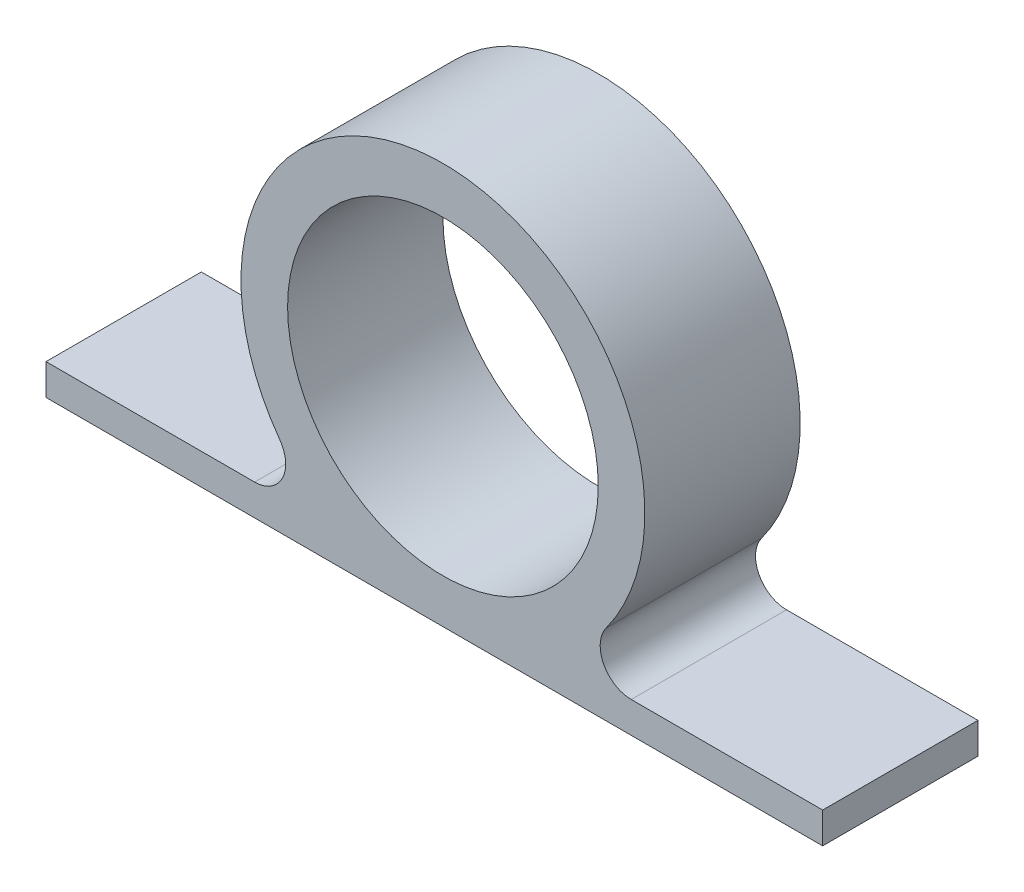
ISO-10303-21;
HEADER;
FILE_DESCRIPTION(('STEP AP214'),'2;1');
FILE_NAME('part.step','',(''),(''),'','','');
FILE_SCHEMA(('AUTOMOTIVE_DESIGN { 1 0 10303 214 1 1 1 1 }'));
ENDSEC;
DATA;
#1=APPLICATION_CONTEXT('core data for automotive mechanical design processes');
#2=APPLICATION_PROTOCOL_DEFINITION('international standard','automotive_design',2000,#1);
#3=PRODUCT_CONTEXT('',#1,'mechanical');
#4=PRODUCT('Part','Part','',(#3));
#5=PRODUCT_RELATED_PRODUCT_CATEGORY('part','',(#4));
#6=PRODUCT_DEFINITION_FORMATION('','',#4);
#7=PRODUCT_DEFINITION_CONTEXT('part definition',#1,'design');
#8=PRODUCT_DEFINITION('design','',#6,#7);
#9=PRODUCT_DEFINITION_SHAPE('','',#8);
#10=(LENGTH_UNIT() NAMED_UNIT(*) SI_UNIT(.MILLI.,.METRE.));
#11=(NAMED_UNIT(*) PLANE_ANGLE_UNIT() SI_UNIT($,.RADIAN.));
#12=(NAMED_UNIT(*) SI_UNIT($,.STERADIAN.) SOLID_ANGLE_UNIT());
#13=UNCERTAINTY_MEASURE_WITH_UNIT(LENGTH_MEASURE(1.E-05),#10,'distance_accuracy_value','');
#14=(GEOMETRIC_REPRESENTATION_CONTEXT(3) GLOBAL_UNCERTAINTY_ASSIGNED_CONTEXT((#13)) GLOBAL_UNIT_ASSIGNED_CONTEXT((#10,
#11,#12)) REPRESENTATION_CONTEXT('',''));
#15=CARTESIAN_POINT('',(0.,0.,0.));
#16=DIRECTION('',(0.,0.,1.));
#17=DIRECTION('',(1.,0.,0.));
#18=AXIS2_PLACEMENT_3D('',#15,#16,#17);
#19=CARTESIAN_POINT('',(12.1232100626122,-8.83333333333334,10.));
#20=DIRECTION('',(0.,0.,-1.));
#21=DIRECTION('',(-1.,0.,0.));
#22=AXIS2_PLACEMENT_3D('',#19,#20,#21);
#23=PLANE('',#22);
#24=CARTESIAN_POINT('',(12.1232100626122,-8.83333333333334,10.));
#25=DIRECTION('',(0.,0.,-1.));
#26=DIRECTION('',(-1.,0.,0.));
#27=AXIS2_PLACEMENT_3D('',#24,#25,#26);
#28=CIRCLE('',#27,2.);
#29=CARTESIAN_POINT('',(12.1232100626122,-10.8333333333333,10.));
#30=VERTEX_POINT('',#29);
#31=CARTESIAN_POINT('',(10.5067820542639,-7.65555555555556,10.));
#32=VERTEX_POINT('',#31);
#33=EDGE_CURVE('E145',#30,#32,#28,.T.);
#34=ORIENTED_EDGE('',*,*,#33,.T.);
#35=CARTESIAN_POINT('',(0.,0.,10.));
#36=DIRECTION('',(0.,0.,1.));
#37=DIRECTION('',(1.,0.,0.));
#38=AXIS2_PLACEMENT_3D('',#35,#36,#37);
#39=CIRCLE('',#38,13.);
#40=CARTESIAN_POINT('',(-10.5067820542639,-7.65555555555556,10.));
#41=VERTEX_POINT('',#40);
#42=EDGE_CURVE('E93',#32,#41,#39,.T.);
#43=ORIENTED_EDGE('',*,*,#42,.T.);
#44=CARTESIAN_POINT('',(-12.1232100626122,-8.83333333333334,10.));
#45=DIRECTION('',(0.,0.,-1.));
#46=DIRECTION('',(1.,0.,0.));
#47=AXIS2_PLACEMENT_3D('',#44,#45,#46);
#48=CIRCLE('',#47,2.);
#49=CARTESIAN_POINT('',(-12.1232100626122,-10.8333333333333,10.));
#50=VERTEX_POINT('',#49);
#51=EDGE_CURVE('E160',#41,#50,#48,.T.);
#52=ORIENTED_EDGE('',*,*,#51,.T.);
#53=DIRECTION('',(-1.,0.,0.));
#54=VECTOR('',#53,1.);
#55=CARTESIAN_POINT('',(-25.5527707983926,-10.8333333333333,10.));
#56=LINE('',#55,#54);
#57=CARTESIAN_POINT('',(-25.5527707983926,-10.8333333333333,10.));
#58=VERTEX_POINT('',#57);
#59=EDGE_CURVE('E173',#50,#58,#56,.T.);
#60=ORIENTED_EDGE('',*,*,#59,.T.);
#61=DIRECTION('',(0.,-1.,0.));
#62=VECTOR('',#61,1.);
#63=CARTESIAN_POINT('',(-25.5527707983926,-12.8333333333333,10.));
#64=LINE('',#63,#62);
#65=CARTESIAN_POINT('',(-25.5527707983926,-12.8333333333333,10.));
#66=VERTEX_POINT('',#65);
#67=EDGE_CURVE('E112',#58,#66,#64,.T.);
#68=ORIENTED_EDGE('',*,*,#67,.T.);
#69=DIRECTION('',(1.,0.,0.));
#70=VECTOR('',#69,1.);
#71=CARTESIAN_POINT('',(0.,-12.8333333333333,10.));
#72=LINE('',#71,#70);
#73=CARTESIAN_POINT('',(24.4472292016074,-12.8333333333333,10.));
#74=VERTEX_POINT('',#73);
#75=EDGE_CURVE('E106',#66,#74,#72,.T.);
#76=ORIENTED_EDGE('',*,*,#75,.T.);
#77=DIRECTION('',(0.,1.,0.));
#78=VECTOR('',#77,1.);
#79=CARTESIAN_POINT('',(24.4472292016074,-12.8333333333333,10.));
#80=LINE('',#79,#78);
#81=CARTESIAN_POINT('',(24.4472292016074,-10.8333333333333,10.));
#82=VERTEX_POINT('',#81);
#83=EDGE_CURVE('E110',#74,#82,#80,.T.);
#84=ORIENTED_EDGE('',*,*,#83,.T.);
#85=DIRECTION('',(-1.,0.,0.));
#86=VECTOR('',#85,1.);
#87=CARTESIAN_POINT('',(24.4472292016074,-10.8333333333333,10.));
#88=LINE('',#87,#86);
#89=EDGE_CURVE('E50',#82,#30,#88,.T.);
#90=ORIENTED_EDGE('',*,*,#89,.T.);
#91=EDGE_LOOP('',(#34,#43,#52,#60,#68,#76,#84,#90));
#92=FACE_BOUND('',#91,.T.);
#93=CARTESIAN_POINT('',(0.,0.,10.));
#94=DIRECTION('',(0.,0.,1.));
#95=DIRECTION('',(1.,0.,0.));
#96=AXIS2_PLACEMENT_3D('',#93,#94,#95);
#97=CIRCLE('',#96,10.);
#98=CARTESIAN_POINT('',(10.,0.,10.));
#99=VERTEX_POINT('',#98);
#100=EDGE_CURVE('E133',#99,#99,#97,.T.);
#101=ORIENTED_EDGE('',*,*,#100,.F.);
#102=EDGE_LOOP('',(#101));
#103=FACE_BOUND('',#102,.T.);
#104=ADVANCED_FACE('F33',(#92,#103),#23,.F.);
#105=CARTESIAN_POINT('',(12.1232100626122,-8.83333333333334,0.));
#106=DIRECTION('',(0.,0.,-1.));
#107=DIRECTION('',(-1.,0.,0.));
#108=AXIS2_PLACEMENT_3D('',#105,#106,#107);
#109=PLANE('',#108);
#110=CARTESIAN_POINT('',(12.1232100626122,-8.83333333333334,0.));
#111=DIRECTION('',(0.,0.,-1.));
#112=DIRECTION('',(-1.,0.,0.));
#113=AXIS2_PLACEMENT_3D('',#110,#111,#112);
#114=CIRCLE('',#113,2.);
#115=CARTESIAN_POINT('',(12.1232100626122,-10.8333333333333,0.));
#116=VERTEX_POINT('',#115);
#117=CARTESIAN_POINT('',(10.5067820542639,-7.65555555555556,0.));
#118=VERTEX_POINT('',#117);
#119=EDGE_CURVE('E129',#116,#118,#114,.T.);
#120=ORIENTED_EDGE('',*,*,#119,.F.);
#121=DIRECTION('',(-1.,0.,0.));
#122=VECTOR('',#121,1.);
#123=CARTESIAN_POINT('',(24.4472292016074,-10.8333333333333,0.));
#124=LINE('',#123,#122);
#125=CARTESIAN_POINT('',(24.4472292016074,-10.8333333333333,0.));
#126=VERTEX_POINT('',#125);
#127=EDGE_CURVE('E85',#126,#116,#124,.T.);
#128=ORIENTED_EDGE('',*,*,#127,.F.);
#129=DIRECTION('',(0.,1.,0.));
#130=VECTOR('',#129,1.);
#131=CARTESIAN_POINT('',(24.4472292016074,-12.8333333333333,0.));
#132=LINE('',#131,#130);
#133=CARTESIAN_POINT('',(24.4472292016074,-12.8333333333333,0.));
#134=VERTEX_POINT('',#133);
#135=EDGE_CURVE('E79',#134,#126,#132,.T.);
#136=ORIENTED_EDGE('',*,*,#135,.F.);
#137=DIRECTION('',(1.,0.,0.));
#138=VECTOR('',#137,1.);
#139=CARTESIAN_POINT('',(0.,-12.8333333333333,0.));
#140=LINE('',#139,#138);
#141=CARTESIAN_POINT('',(-25.5527707983926,-12.8333333333333,0.));
#142=VERTEX_POINT('',#141);
#143=EDGE_CURVE('E119',#142,#134,#140,.T.);
#144=ORIENTED_EDGE('',*,*,#143,.F.);
#145=DIRECTION('',(0.,-1.,0.));
#146=VECTOR('',#145,1.);
#147=CARTESIAN_POINT('',(-25.5527707983926,-12.8333333333333,0.));
#148=LINE('',#147,#146);
#149=CARTESIAN_POINT('',(-25.5527707983926,-10.8333333333333,0.));
#150=VERTEX_POINT('',#149);
#151=EDGE_CURVE('E139',#150,#142,#148,.T.);
#152=ORIENTED_EDGE('',*,*,#151,.F.);
#153=DIRECTION('',(-1.,0.,0.));
#154=VECTOR('',#153,1.);
#155=CARTESIAN_POINT('',(-25.5527707983926,-10.8333333333333,0.));
#156=LINE('',#155,#154);
#157=CARTESIAN_POINT('',(-12.1232100626122,-10.8333333333333,0.));
#158=VERTEX_POINT('',#157);
#159=EDGE_CURVE('E137',#158,#150,#156,.T.);
#160=ORIENTED_EDGE('',*,*,#159,.F.);
#161=CARTESIAN_POINT('',(-12.1232100626122,-8.83333333333334,0.));
#162=DIRECTION('',(0.,0.,-1.));
#163=DIRECTION('',(1.,0.,0.));
#164=AXIS2_PLACEMENT_3D('',#161,#162,#163);
#165=CIRCLE('',#164,2.);
#166=CARTESIAN_POINT('',(-10.5067820542639,-7.65555555555556,0.));
#167=VERTEX_POINT('',#166);
#168=EDGE_CURVE('E135',#167,#158,#165,.T.);
#169=ORIENTED_EDGE('',*,*,#168,.F.);
#170=CARTESIAN_POINT('',(0.,0.,0.));
#171=DIRECTION('',(0.,0.,1.));
#172=DIRECTION('',(1.,0.,0.));
#173=AXIS2_PLACEMENT_3D('',#170,#171,#172);
#174=CIRCLE('',#173,13.);
#175=EDGE_CURVE('E132',#118,#167,#174,.T.);
#176=ORIENTED_EDGE('',*,*,#175,.F.);
#177=EDGE_LOOP('',(#120,#128,#136,#144,#152,#160,#169,#176));
#178=FACE_BOUND('',#177,.T.);
#179=CARTESIAN_POINT('',(0.,0.,0.));
#180=DIRECTION('',(0.,0.,1.));
#181=DIRECTION('',(1.,0.,0.));
#182=AXIS2_PLACEMENT_3D('',#179,#180,#181);
#183=CIRCLE('',#182,10.);
#184=CARTESIAN_POINT('',(10.,0.,0.));
#185=VERTEX_POINT('',#184);
#186=EDGE_CURVE('E179',#185,#185,#183,.T.);
#187=ORIENTED_EDGE('',*,*,#186,.T.);
#188=EDGE_LOOP('',(#187));
#189=FACE_BOUND('',#188,.T.);
#190=ADVANCED_FACE('F164',(#178,#189),#109,.T.);
#191=CARTESIAN_POINT('',(12.1232100626122,-8.83333333333334,10.));
#192=DIRECTION('',(0.,0.,-1.));
#193=DIRECTION('',(-1.,0.,0.));
#194=AXIS2_PLACEMENT_3D('',#191,#192,#193);
#195=CYLINDRICAL_SURFACE('',#194,2.);
#196=ORIENTED_EDGE('',*,*,#119,.T.);
#197=DIRECTION('',(0.,0.,-1.));
#198=VECTOR('',#197,1.);
#199=CARTESIAN_POINT('',(10.5067820542639,-7.65555555555556,10.));
#200=LINE('',#199,#198);
#201=EDGE_CURVE('E11',#32,#118,#200,.T.);
#202=ORIENTED_EDGE('',*,*,#201,.F.);
#203=ORIENTED_EDGE('',*,*,#33,.F.);
#204=DIRECTION('',(0.,0.,-1.));
#205=VECTOR('',#204,1.);
#206=CARTESIAN_POINT('',(12.1232100626122,-10.8333333333333,10.));
#207=LINE('',#206,#205);
#208=EDGE_CURVE('E125',#30,#116,#207,.T.);
#209=ORIENTED_EDGE('',*,*,#208,.T.);
#210=EDGE_LOOP('',(#196,#202,#203,#209));
#211=FACE_BOUND('',#210,.T.);
#212=ADVANCED_FACE('F35',(#211),#195,.F.);
#213=CARTESIAN_POINT('',(0.,0.,10.));
#214=DIRECTION('',(0.,0.,-1.));
#215=DIRECTION('',(-1.,0.,0.));
#216=AXIS2_PLACEMENT_3D('',#213,#214,#215);
#217=CYLINDRICAL_SURFACE('',#216,13.);
#218=ORIENTED_EDGE('',*,*,#175,.T.);
#219=DIRECTION('',(0.,0.,-1.));
#220=VECTOR('',#219,1.);
#221=CARTESIAN_POINT('',(-10.5067820542639,-7.65555555555556,10.));
#222=LINE('',#221,#220);
#223=EDGE_CURVE('E42',#41,#167,#222,.T.);
#224=ORIENTED_EDGE('',*,*,#223,.F.);
#225=ORIENTED_EDGE('',*,*,#42,.F.);
#226=ORIENTED_EDGE('',*,*,#201,.T.);
#227=EDGE_LOOP('',(#218,#224,#225,#226));
#228=FACE_BOUND('',#227,.T.);
#229=ADVANCED_FACE('F207',(#228),#217,.T.);
#230=CARTESIAN_POINT('',(-12.1232100626122,-8.83333333333334,10.));
#231=DIRECTION('',(0.,0.,-1.));
#232=DIRECTION('',(-1.,0.,0.));
#233=AXIS2_PLACEMENT_3D('',#230,#231,#232);
#234=CYLINDRICAL_SURFACE('',#233,2.);
#235=ORIENTED_EDGE('',*,*,#168,.T.);
#236=DIRECTION('',(0.,0.,-1.));
#237=VECTOR('',#236,1.);
#238=CARTESIAN_POINT('',(-12.1232100626122,-10.8333333333333,10.));
#239=LINE('',#238,#237);
#240=EDGE_CURVE('E152',#50,#158,#239,.T.);
#241=ORIENTED_EDGE('',*,*,#240,.F.);
#242=ORIENTED_EDGE('',*,*,#51,.F.);
#243=ORIENTED_EDGE('',*,*,#223,.T.);
#244=EDGE_LOOP('',(#235,#241,#242,#243));
#245=FACE_BOUND('',#244,.T.);
#246=ADVANCED_FACE('F158',(#245),#234,.F.);
#247=CARTESIAN_POINT('',(-25.5527707983926,-10.8333333333333,10.));
#248=DIRECTION('',(0.,-1.,0.));
#249=DIRECTION('',(1.,0.,0.));
#250=AXIS2_PLACEMENT_3D('',#247,#248,#249);
#251=PLANE('',#250);
#252=ORIENTED_EDGE('',*,*,#159,.T.);
#253=DIRECTION('',(0.,0.,-1.));
#254=VECTOR('',#253,1.);
#255=CARTESIAN_POINT('',(-25.5527707983926,-10.8333333333333,10.));
#256=LINE('',#255,#254);
#257=EDGE_CURVE('E149',#58,#150,#256,.T.);
#258=ORIENTED_EDGE('',*,*,#257,.F.);
#259=ORIENTED_EDGE('',*,*,#59,.F.);
#260=ORIENTED_EDGE('',*,*,#240,.T.);
#261=EDGE_LOOP('',(#252,#258,#259,#260));
#262=FACE_BOUND('',#261,.T.);
#263=ADVANCED_FACE('F169',(#262),#251,.F.);
#264=CARTESIAN_POINT('',(-25.5527707983926,-12.8333333333333,10.));
#265=DIRECTION('',(1.,0.,0.));
#266=DIRECTION('',(0.,1.,0.));
#267=AXIS2_PLACEMENT_3D('',#264,#265,#266);
#268=PLANE('',#267);
#269=ORIENTED_EDGE('',*,*,#151,.T.);
#270=DIRECTION('',(0.,0.,-1.));
#271=VECTOR('',#270,1.);
#272=CARTESIAN_POINT('',(-25.5527707983926,-12.8333333333333,10.));
#273=LINE('',#272,#271);
#274=EDGE_CURVE('E120',#66,#142,#273,.T.);
#275=ORIENTED_EDGE('',*,*,#274,.F.);
#276=ORIENTED_EDGE('',*,*,#67,.F.);
#277=ORIENTED_EDGE('',*,*,#257,.T.);
#278=EDGE_LOOP('',(#269,#275,#276,#277));
#279=FACE_BOUND('',#278,.T.);
#280=ADVANCED_FACE('F172',(#279),#268,.F.);
#281=CARTESIAN_POINT('',(0.,-12.8333333333333,10.));
#282=DIRECTION('',(0.,1.,0.));
#283=DIRECTION('',(0.,0.,1.));
#284=AXIS2_PLACEMENT_3D('',#281,#282,#283);
#285=PLANE('',#284);
#286=ORIENTED_EDGE('',*,*,#143,.T.);
#287=DIRECTION('',(0.,0.,-1.));
#288=VECTOR('',#287,1.);
#289=CARTESIAN_POINT('',(24.4472292016074,-12.8333333333333,10.));
#290=LINE('',#289,#288);
#291=EDGE_CURVE('E117',#74,#134,#290,.T.);
#292=ORIENTED_EDGE('',*,*,#291,.F.);
#293=ORIENTED_EDGE('',*,*,#75,.F.);
#294=ORIENTED_EDGE('',*,*,#274,.T.);
#295=EDGE_LOOP('',(#286,#292,#293,#294));
#296=FACE_BOUND('',#295,.T.);
#297=ADVANCED_FACE('F118',(#296),#285,.F.);
#298=CARTESIAN_POINT('',(24.4472292016074,-12.8333333333333,10.));
#299=DIRECTION('',(-1.,0.,0.));
#300=DIRECTION('',(0.,-1.,0.));
#301=AXIS2_PLACEMENT_3D('',#298,#299,#300);
#302=PLANE('',#301);
#303=ORIENTED_EDGE('',*,*,#135,.T.);
#304=DIRECTION('',(0.,0.,-1.));
#305=VECTOR('',#304,1.);
#306=CARTESIAN_POINT('',(24.4472292016074,-10.8333333333333,10.));
#307=LINE('',#306,#305);
#308=EDGE_CURVE('E121',#82,#126,#307,.T.);
#309=ORIENTED_EDGE('',*,*,#308,.F.);
#310=ORIENTED_EDGE('',*,*,#83,.F.);
#311=ORIENTED_EDGE('',*,*,#291,.T.);
#312=EDGE_LOOP('',(#303,#309,#310,#311));
#313=FACE_BOUND('',#312,.T.);
#314=ADVANCED_FACE('F123',(#313),#302,.F.);
#315=CARTESIAN_POINT('',(24.4472292016074,-10.8333333333333,10.));
#316=DIRECTION('',(0.,-1.,0.));
#317=DIRECTION('',(0.,0.,-1.));
#318=AXIS2_PLACEMENT_3D('',#315,#316,#317);
#319=PLANE('',#318);
#320=ORIENTED_EDGE('',*,*,#127,.T.);
#321=ORIENTED_EDGE('',*,*,#208,.F.);
#322=ORIENTED_EDGE('',*,*,#89,.F.);
#323=ORIENTED_EDGE('',*,*,#308,.T.);
#324=EDGE_LOOP('',(#320,#321,#322,#323));
#325=FACE_BOUND('',#324,.T.);
#326=ADVANCED_FACE('F195',(#325),#319,.F.);
#327=CARTESIAN_POINT('',(0.,0.,10.));
#328=DIRECTION('',(0.,0.,-1.));
#329=DIRECTION('',(-1.,0.,0.));
#330=AXIS2_PLACEMENT_3D('',#327,#328,#329);
#331=CYLINDRICAL_SURFACE('',#330,10.);
#332=ORIENTED_EDGE('',*,*,#100,.T.);
#333=EDGE_LOOP('',(#332));
#334=FACE_BOUND('',#333,.T.);
#335=ORIENTED_EDGE('',*,*,#186,.F.);
#336=EDGE_LOOP('',(#335));
#337=FACE_BOUND('',#336,.T.);
#338=ADVANCED_FACE('F185',(#334,#337),#331,.F.);
#339=CLOSED_SHELL('',(#104,#190,#212,#229,#246,#263,#280,#297,#314,#326,#338));
#340=MANIFOLD_SOLID_BREP('B2',#339);
#341=ADVANCED_BREP_SHAPE_REPRESENTATION('',(#18,#340),#14);
#342=SHAPE_DEFINITION_REPRESENTATION(#9,#341);
ENDSEC;
END-ISO-10303-21;
